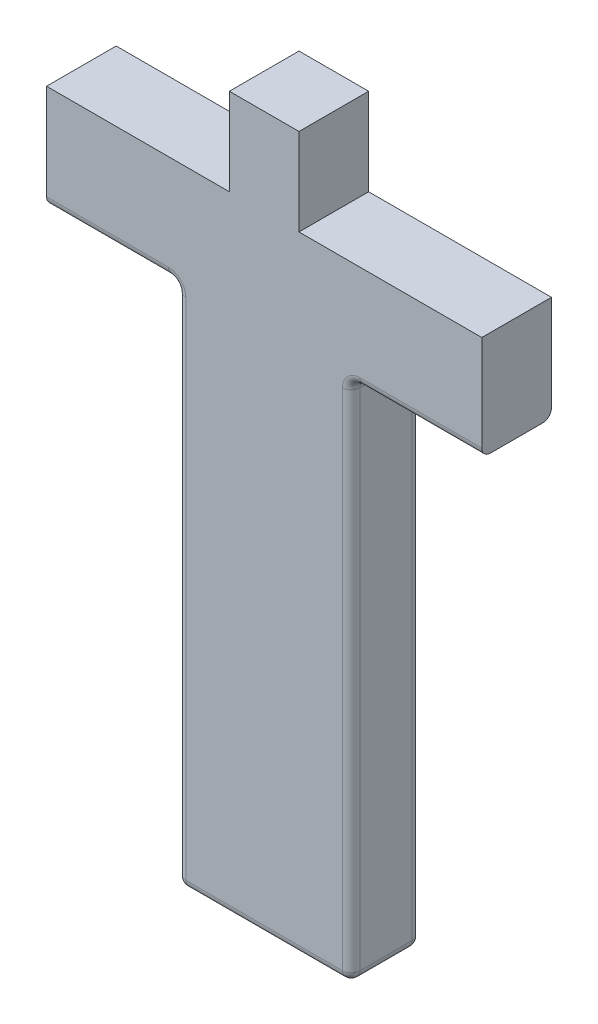
ISO-10303-21;
HEADER;
FILE_DESCRIPTION(('STEP AP214'),'2;1');
FILE_NAME('part.step','',(''),(''),'','','');
FILE_SCHEMA(('AUTOMOTIVE_DESIGN { 1 0 10303 214 1 1 1 1 }'));
ENDSEC;
DATA;
#1=APPLICATION_CONTEXT('core data for automotive mechanical design processes');
#2=APPLICATION_PROTOCOL_DEFINITION('international standard','automotive_design',2000,#1);
#3=PRODUCT_CONTEXT('',#1,'mechanical');
#4=PRODUCT('Part','Part','',(#3));
#5=PRODUCT_RELATED_PRODUCT_CATEGORY('part','',(#4));
#6=PRODUCT_DEFINITION_FORMATION('','',#4);
#7=PRODUCT_DEFINITION_CONTEXT('part definition',#1,'design');
#8=PRODUCT_DEFINITION('design','',#6,#7);
#9=PRODUCT_DEFINITION_SHAPE('','',#8);
#10=(LENGTH_UNIT() NAMED_UNIT(*) SI_UNIT(.MILLI.,.METRE.));
#11=(NAMED_UNIT(*) PLANE_ANGLE_UNIT() SI_UNIT($,.RADIAN.));
#12=(NAMED_UNIT(*) SI_UNIT($,.STERADIAN.) SOLID_ANGLE_UNIT());
#13=UNCERTAINTY_MEASURE_WITH_UNIT(LENGTH_MEASURE(1.E-05),#10,'distance_accuracy_value','');
#14=(GEOMETRIC_REPRESENTATION_CONTEXT(3) GLOBAL_UNCERTAINTY_ASSIGNED_CONTEXT((#13)) GLOBAL_UNIT_ASSIGNED_CONTEXT((#10,
#11,#12)) REPRESENTATION_CONTEXT('',''));
#15=CARTESIAN_POINT('',(0.,0.,0.));
#16=DIRECTION('',(0.,0.,1.));
#17=DIRECTION('',(1.,0.,0.));
#18=AXIS2_PLACEMENT_3D('',#15,#16,#17);
#19=CARTESIAN_POINT('',(0.,0.,8.));
#20=DIRECTION('',(0.,0.,1.));
#21=DIRECTION('',(1.,0.,0.));
#22=AXIS2_PLACEMENT_3D('',#19,#20,#21);
#23=PLANE('',#22);
#24=CARTESIAN_POINT('',(-11.,-7.,8.));
#25=DIRECTION('',(0.,0.,1.));
#26=DIRECTION('',(1.,0.,0.));
#27=AXIS2_PLACEMENT_3D('',#24,#25,#26);
#28=CIRCLE('',#27,2.);
#29=CARTESIAN_POINT('',(-8.99999999999999,-7.,8.));
#30=VERTEX_POINT('',#29);
#31=CARTESIAN_POINT('',(-11.,-5.,8.));
#32=VERTEX_POINT('',#31);
#33=EDGE_CURVE('E367',#30,#32,#28,.T.);
#34=ORIENTED_EDGE('',*,*,#33,.F.);
#35=DIRECTION('',(0.,-1.,0.));
#36=VECTOR('',#35,1.);
#37=CARTESIAN_POINT('',(-8.99999999999999,-66.,8.));
#38=LINE('',#37,#36);
#39=CARTESIAN_POINT('',(-8.99999999999999,-65.,8.));
#40=VERTEX_POINT('',#39);
#41=EDGE_CURVE('E363',#30,#40,#38,.T.);
#42=ORIENTED_EDGE('',*,*,#41,.T.);
#43=DIRECTION('',(1.,0.,0.));
#44=VECTOR('',#43,1.);
#45=CARTESIAN_POINT('',(9.00000000000001,-65.,8.));
#46=LINE('',#45,#44);
#47=CARTESIAN_POINT('',(9.00000000000001,-65.,8.));
#48=VERTEX_POINT('',#47);
#49=EDGE_CURVE('E365',#40,#48,#46,.T.);
#50=ORIENTED_EDGE('',*,*,#49,.T.);
#51=DIRECTION('',(0.,-1.,0.));
#52=VECTOR('',#51,1.);
#53=CARTESIAN_POINT('',(9.00000000000001,0.,8.));
#54=LINE('',#53,#52);
#55=CARTESIAN_POINT('',(9.00000000000001,-7.,8.));
#56=VERTEX_POINT('',#55);
#57=EDGE_CURVE('E303',#48,#56,#54,.F.);
#58=ORIENTED_EDGE('',*,*,#57,.T.);
#59=CARTESIAN_POINT('',(11.,-7.,8.));
#60=DIRECTION('',(0.,0.,1.));
#61=DIRECTION('',(1.,0.,0.));
#62=AXIS2_PLACEMENT_3D('',#59,#60,#61);
#63=CIRCLE('',#62,2.);
#64=CARTESIAN_POINT('',(11.,-5.,8.));
#65=VERTEX_POINT('',#64);
#66=EDGE_CURVE('E300',#65,#56,#63,.T.);
#67=ORIENTED_EDGE('',*,*,#66,.F.);
#68=DIRECTION('',(1.,0.,0.));
#69=VECTOR('',#68,1.);
#70=CARTESIAN_POINT('',(25.,-5.,8.));
#71=LINE('',#70,#69);
#72=CARTESIAN_POINT('',(25.,-5.,8.));
#73=VERTEX_POINT('',#72);
#74=EDGE_CURVE('E298',#65,#73,#71,.T.);
#75=ORIENTED_EDGE('',*,*,#74,.T.);
#76=DIRECTION('',(0.,-1.,0.));
#77=VECTOR('',#76,1.);
#78=CARTESIAN_POINT('',(25.,0.,8.));
#79=LINE('',#78,#77);
#80=CARTESIAN_POINT('',(25.,6.,8.));
#81=VERTEX_POINT('',#80);
#82=EDGE_CURVE('E225',#81,#73,#79,.T.);
#83=ORIENTED_EDGE('',*,*,#82,.F.);
#84=DIRECTION('',(1.,0.,0.));
#85=VECTOR('',#84,1.);
#86=CARTESIAN_POINT('',(0.,6.,8.));
#87=LINE('',#86,#85);
#88=CARTESIAN_POINT('',(4.00000000000001,6.,8.));
#89=VERTEX_POINT('',#88);
#90=EDGE_CURVE('E224',#89,#81,#87,.T.);
#91=ORIENTED_EDGE('',*,*,#90,.F.);
#92=DIRECTION('',(0.,1.,0.));
#93=VECTOR('',#92,1.);
#94=CARTESIAN_POINT('',(4.00000000000001,0.,8.));
#95=LINE('',#94,#93);
#96=CARTESIAN_POINT('',(4.00000000000001,16.,8.));
#97=VERTEX_POINT('',#96);
#98=EDGE_CURVE('E228',#89,#97,#95,.T.);
#99=ORIENTED_EDGE('',*,*,#98,.T.);
#100=DIRECTION('',(1.,0.,0.));
#101=VECTOR('',#100,1.);
#102=CARTESIAN_POINT('',(0.,16.,8.));
#103=LINE('',#102,#101);
#104=CARTESIAN_POINT('',(-3.99999999999999,16.,8.));
#105=VERTEX_POINT('',#104);
#106=EDGE_CURVE('E217',#105,#97,#103,.T.);
#107=ORIENTED_EDGE('',*,*,#106,.F.);
#108=DIRECTION('',(0.,1.,0.));
#109=VECTOR('',#108,1.);
#110=CARTESIAN_POINT('',(-3.99999999999999,0.,8.));
#111=LINE('',#110,#109);
#112=CARTESIAN_POINT('',(-3.99999999999999,6.,8.));
#113=VERTEX_POINT('',#112);
#114=EDGE_CURVE('E201',#113,#105,#111,.T.);
#115=ORIENTED_EDGE('',*,*,#114,.F.);
#116=CARTESIAN_POINT('',(-25.,6.,8.));
#117=VERTEX_POINT('',#116);
#118=EDGE_CURVE('E215',#117,#113,#87,.T.);
#119=ORIENTED_EDGE('',*,*,#118,.F.);
#120=DIRECTION('',(0.,-1.,0.));
#121=VECTOR('',#120,1.);
#122=CARTESIAN_POINT('',(-25.,0.,8.));
#123=LINE('',#122,#121);
#124=CARTESIAN_POINT('',(-25.,-5.,8.));
#125=VERTEX_POINT('',#124);
#126=EDGE_CURVE('E222',#117,#125,#123,.T.);
#127=ORIENTED_EDGE('',*,*,#126,.T.);
#128=DIRECTION('',(1.,0.,0.));
#129=VECTOR('',#128,1.);
#130=CARTESIAN_POINT('',(-9.99999999999999,-5.,8.));
#131=LINE('',#130,#129);
#132=EDGE_CURVE('E209',#125,#32,#131,.T.);
#133=ORIENTED_EDGE('',*,*,#132,.T.);
#134=EDGE_LOOP('',(#34,#42,#50,#58,#67,#75,#83,#91,#99,#107,#115,#119,#127,#133));
#135=FACE_BOUND('',#134,.T.);
#136=ADVANCED_FACE('F35',(#135),#23,.T.);
#137=CARTESIAN_POINT('',(-3.99999999999999,0.,8.));
#138=DIRECTION('',(-1.,0.,0.));
#139=DIRECTION('',(0.,0.,1.));
#140=AXIS2_PLACEMENT_3D('',#137,#138,#139);
#141=PLANE('',#140);
#142=DIRECTION('',(0.,1.,0.));
#143=VECTOR('',#142,1.);
#144=CARTESIAN_POINT('',(-3.99999999999999,0.,0.));
#145=LINE('',#144,#143);
#146=CARTESIAN_POINT('',(-3.99999999999999,6.,0.));
#147=VERTEX_POINT('',#146);
#148=CARTESIAN_POINT('',(-3.99999999999999,16.,0.));
#149=VERTEX_POINT('',#148);
#150=EDGE_CURVE('E204',#147,#149,#145,.T.);
#151=ORIENTED_EDGE('',*,*,#150,.F.);
#152=DIRECTION('',(0.,0.,-1.));
#153=VECTOR('',#152,1.);
#154=CARTESIAN_POINT('',(-3.99999999999999,6.,8.));
#155=LINE('',#154,#153);
#156=EDGE_CURVE('E198',#113,#147,#155,.T.);
#157=ORIENTED_EDGE('',*,*,#156,.F.);
#158=ORIENTED_EDGE('',*,*,#114,.T.);
#159=DIRECTION('',(0.,0.,-1.));
#160=VECTOR('',#159,1.);
#161=CARTESIAN_POINT('',(-3.99999999999999,16.,8.));
#162=LINE('',#161,#160);
#163=EDGE_CURVE('E239',#105,#149,#162,.T.);
#164=ORIENTED_EDGE('',*,*,#163,.T.);
#165=EDGE_LOOP('',(#151,#157,#158,#164));
#166=FACE_BOUND('',#165,.T.);
#167=ADVANCED_FACE('F200',(#166),#141,.T.);
#168=CARTESIAN_POINT('',(0.,6.,8.));
#169=DIRECTION('',(0.,1.,0.));
#170=DIRECTION('',(0.,0.,1.));
#171=AXIS2_PLACEMENT_3D('',#168,#169,#170);
#172=PLANE('',#171);
#173=DIRECTION('',(1.,0.,0.));
#174=VECTOR('',#173,1.);
#175=CARTESIAN_POINT('',(0.,6.,0.));
#176=LINE('',#175,#174);
#177=CARTESIAN_POINT('',(-25.,6.,0.));
#178=VERTEX_POINT('',#177);
#179=EDGE_CURVE('E241',#178,#147,#176,.T.);
#180=ORIENTED_EDGE('',*,*,#179,.F.);
#181=DIRECTION('',(0.,0.,-1.));
#182=VECTOR('',#181,1.);
#183=CARTESIAN_POINT('',(-25.,6.,8.));
#184=LINE('',#183,#182);
#185=EDGE_CURVE('E210',#117,#178,#184,.T.);
#186=ORIENTED_EDGE('',*,*,#185,.F.);
#187=ORIENTED_EDGE('',*,*,#118,.T.);
#188=ORIENTED_EDGE('',*,*,#156,.T.);
#189=EDGE_LOOP('',(#180,#186,#187,#188));
#190=FACE_BOUND('',#189,.T.);
#191=ADVANCED_FACE('F220',(#190),#172,.T.);
#192=CARTESIAN_POINT('',(-25.,0.,8.));
#193=DIRECTION('',(1.,0.,0.));
#194=DIRECTION('',(0.,0.,-1.));
#195=AXIS2_PLACEMENT_3D('',#192,#193,#194);
#196=PLANE('',#195);
#197=DIRECTION('',(0.,-1.,0.));
#198=VECTOR('',#197,1.);
#199=CARTESIAN_POINT('',(-25.,0.,0.));
#200=LINE('',#199,#198);
#201=CARTESIAN_POINT('',(-25.,-5.,0.));
#202=VERTEX_POINT('',#201);
#203=EDGE_CURVE('E244',#178,#202,#200,.T.);
#204=ORIENTED_EDGE('',*,*,#203,.T.);
#205=CARTESIAN_POINT('',(-25.,-5.,1.));
#206=DIRECTION('',(1.,0.,0.));
#207=DIRECTION('',(0.,0.,-1.));
#208=AXIS2_PLACEMENT_3D('',#205,#206,#207);
#209=CIRCLE('',#208,1.);
#210=CARTESIAN_POINT('',(-25.,-6.,1.));
#211=VERTEX_POINT('',#210);
#212=EDGE_CURVE('E326',#202,#211,#209,.F.);
#213=ORIENTED_EDGE('',*,*,#212,.T.);
#214=DIRECTION('',(0.,0.,-1.));
#215=VECTOR('',#214,1.);
#216=CARTESIAN_POINT('',(-25.,-6.,8.));
#217=LINE('',#216,#215);
#218=CARTESIAN_POINT('',(-25.,-6.,7.));
#219=VERTEX_POINT('',#218);
#220=EDGE_CURVE('E266',#219,#211,#217,.T.);
#221=ORIENTED_EDGE('',*,*,#220,.F.);
#222=CARTESIAN_POINT('',(-25.,-5.,7.));
#223=DIRECTION('',(1.,0.,0.));
#224=DIRECTION('',(0.,0.,-1.));
#225=AXIS2_PLACEMENT_3D('',#222,#223,#224);
#226=CIRCLE('',#225,1.);
#227=EDGE_CURVE('E274',#219,#125,#226,.F.);
#228=ORIENTED_EDGE('',*,*,#227,.T.);
#229=ORIENTED_EDGE('',*,*,#126,.F.);
#230=ORIENTED_EDGE('',*,*,#185,.T.);
#231=EDGE_LOOP('',(#204,#213,#221,#228,#229,#230));
#232=FACE_BOUND('',#231,.T.);
#233=ADVANCED_FACE('F475',(#232),#196,.F.);
#234=CARTESIAN_POINT('',(0.,-6.,8.));
#235=DIRECTION('',(0.,1.,0.));
#236=DIRECTION('',(0.,0.,1.));
#237=AXIS2_PLACEMENT_3D('',#234,#235,#236);
#238=PLANE('',#237);
#239=ORIENTED_EDGE('',*,*,#220,.T.);
#240=DIRECTION('',(1.,0.,0.));
#241=VECTOR('',#240,1.);
#242=CARTESIAN_POINT('',(0.,-6.,1.));
#243=LINE('',#242,#241);
#244=CARTESIAN_POINT('',(-11.,-6.,1.));
#245=VERTEX_POINT('',#244);
#246=EDGE_CURVE('E324',#211,#245,#243,.T.);
#247=ORIENTED_EDGE('',*,*,#246,.T.);
#248=DIRECTION('',(0.,0.,-1.));
#249=VECTOR('',#248,1.);
#250=CARTESIAN_POINT('',(-11.,-6.,7.));
#251=LINE('',#250,#249);
#252=CARTESIAN_POINT('',(-11.,-6.,7.));
#253=VERTEX_POINT('',#252);
#254=EDGE_CURVE('E321',#245,#253,#251,.F.);
#255=ORIENTED_EDGE('',*,*,#254,.T.);
#256=DIRECTION('',(1.,0.,0.));
#257=VECTOR('',#256,1.);
#258=CARTESIAN_POINT('',(-25.,-6.,7.));
#259=LINE('',#258,#257);
#260=EDGE_CURVE('E272',#253,#219,#259,.F.);
#261=ORIENTED_EDGE('',*,*,#260,.T.);
#262=EDGE_LOOP('',(#239,#247,#255,#261));
#263=FACE_BOUND('',#262,.T.);
#264=ADVANCED_FACE('F483',(#263),#238,.F.);
#265=CARTESIAN_POINT('',(-9.99999999999999,0.,8.));
#266=DIRECTION('',(1.,0.,0.));
#267=DIRECTION('',(0.,1.,0.));
#268=AXIS2_PLACEMENT_3D('',#265,#266,#267);
#269=PLANE('',#268);
#270=DIRECTION('',(0.,-1.,0.));
#271=VECTOR('',#270,1.);
#272=CARTESIAN_POINT('',(-9.99999999999999,0.,1.));
#273=LINE('',#272,#271);
#274=CARTESIAN_POINT('',(-9.99999999999999,-7.,1.));
#275=VERTEX_POINT('',#274);
#276=CARTESIAN_POINT('',(-9.99999999999999,-65.,1.));
#277=VERTEX_POINT('',#276);
#278=EDGE_CURVE('E307',#275,#277,#273,.T.);
#279=ORIENTED_EDGE('',*,*,#278,.T.);
#280=DIRECTION('',(0.,0.,-1.));
#281=VECTOR('',#280,1.);
#282=CARTESIAN_POINT('',(-9.99999999999999,-65.,8.));
#283=LINE('',#282,#281);
#284=CARTESIAN_POINT('',(-9.99999999999999,-65.,7.));
#285=VERTEX_POINT('',#284);
#286=EDGE_CURVE('E11',#277,#285,#283,.F.);
#287=ORIENTED_EDGE('',*,*,#286,.T.);
#288=DIRECTION('',(0.,-1.,0.));
#289=VECTOR('',#288,1.);
#290=CARTESIAN_POINT('',(-9.99999999999999,-6.73205080756888,7.));
#291=LINE('',#290,#289);
#292=CARTESIAN_POINT('',(-9.99999999999999,-7.,7.));
#293=VERTEX_POINT('',#292);
#294=EDGE_CURVE('E44',#285,#293,#291,.F.);
#295=ORIENTED_EDGE('',*,*,#294,.T.);
#296=DIRECTION('',(0.,0.,-1.));
#297=VECTOR('',#296,1.);
#298=CARTESIAN_POINT('',(-9.99999999999999,-7.,0.));
#299=LINE('',#298,#297);
#300=EDGE_CURVE('E305',#293,#275,#299,.T.);
#301=ORIENTED_EDGE('',*,*,#300,.T.);
#302=EDGE_LOOP('',(#279,#287,#295,#301));
#303=FACE_BOUND('',#302,.T.);
#304=ADVANCED_FACE('F552',(#303),#269,.F.);
#305=CARTESIAN_POINT('',(0.,-66.,8.));
#306=DIRECTION('',(0.,1.,0.));
#307=DIRECTION('',(0.,0.,1.));
#308=AXIS2_PLACEMENT_3D('',#305,#306,#307);
#309=PLANE('',#308);
#310=DIRECTION('',(1.,0.,0.));
#311=VECTOR('',#310,1.);
#312=CARTESIAN_POINT('',(0.,-66.,1.));
#313=LINE('',#312,#311);
#314=CARTESIAN_POINT('',(-8.99999999999999,-66.,1.));
#315=VERTEX_POINT('',#314);
#316=CARTESIAN_POINT('',(9.00000000000001,-66.,1.));
#317=VERTEX_POINT('',#316);
#318=EDGE_CURVE('E58',#315,#317,#313,.T.);
#319=ORIENTED_EDGE('',*,*,#318,.T.);
#320=DIRECTION('',(0.,0.,-1.));
#321=VECTOR('',#320,1.);
#322=CARTESIAN_POINT('',(9.00000000000001,-66.,7.));
#323=LINE('',#322,#321);
#324=CARTESIAN_POINT('',(9.00000000000001,-66.,7.));
#325=VERTEX_POINT('',#324);
#326=EDGE_CURVE('E377',#317,#325,#323,.F.);
#327=ORIENTED_EDGE('',*,*,#326,.T.);
#328=DIRECTION('',(1.,0.,0.));
#329=VECTOR('',#328,1.);
#330=CARTESIAN_POINT('',(-9.99999999999999,-66.,7.));
#331=LINE('',#330,#329);
#332=CARTESIAN_POINT('',(-8.99999999999999,-66.,7.));
#333=VERTEX_POINT('',#332);
#334=EDGE_CURVE('E372',#325,#333,#331,.F.);
#335=ORIENTED_EDGE('',*,*,#334,.T.);
#336=DIRECTION('',(0.,0.,-1.));
#337=VECTOR('',#336,1.);
#338=CARTESIAN_POINT('',(-8.99999999999999,-66.,8.));
#339=LINE('',#338,#337);
#340=EDGE_CURVE('E374',#333,#315,#339,.T.);
#341=ORIENTED_EDGE('',*,*,#340,.T.);
#342=EDGE_LOOP('',(#319,#327,#335,#341));
#343=FACE_BOUND('',#342,.T.);
#344=ADVANCED_FACE('F512',(#343),#309,.F.);
#345=CARTESIAN_POINT('',(10.,0.,8.));
#346=DIRECTION('',(1.,0.,0.));
#347=DIRECTION('',(0.,1.,0.));
#348=AXIS2_PLACEMENT_3D('',#345,#346,#347);
#349=PLANE('',#348);
#350=DIRECTION('',(0.,-1.,0.));
#351=VECTOR('',#350,1.);
#352=CARTESIAN_POINT('',(10.,0.,7.));
#353=LINE('',#352,#351);
#354=CARTESIAN_POINT('',(10.,-7.,7.));
#355=VERTEX_POINT('',#354);
#356=CARTESIAN_POINT('',(10.,-65.,7.));
#357=VERTEX_POINT('',#356);
#358=EDGE_CURVE('E293',#355,#357,#353,.T.);
#359=ORIENTED_EDGE('',*,*,#358,.T.);
#360=DIRECTION('',(0.,0.,-1.));
#361=VECTOR('',#360,1.);
#362=CARTESIAN_POINT('',(10.,-65.,1.));
#363=LINE('',#362,#361);
#364=CARTESIAN_POINT('',(10.,-65.,1.));
#365=VERTEX_POINT('',#364);
#366=EDGE_CURVE('E370',#357,#365,#363,.T.);
#367=ORIENTED_EDGE('',*,*,#366,.T.);
#368=DIRECTION('',(0.,-1.,0.));
#369=VECTOR('',#368,1.);
#370=CARTESIAN_POINT('',(10.,-6.,1.));
#371=LINE('',#370,#369);
#372=CARTESIAN_POINT('',(10.,-7.,1.));
#373=VERTEX_POINT('',#372);
#374=EDGE_CURVE('E296',#365,#373,#371,.F.);
#375=ORIENTED_EDGE('',*,*,#374,.T.);
#376=DIRECTION('',(0.,0.,-1.));
#377=VECTOR('',#376,1.);
#378=CARTESIAN_POINT('',(10.,-7.,8.));
#379=LINE('',#378,#377);
#380=EDGE_CURVE('E291',#373,#355,#379,.F.);
#381=ORIENTED_EDGE('',*,*,#380,.T.);
#382=EDGE_LOOP('',(#359,#367,#375,#381));
#383=FACE_BOUND('',#382,.T.);
#384=ADVANCED_FACE('F438',(#383),#349,.T.);
#385=DIRECTION('',(0.,0.,-1.));
#386=VECTOR('',#385,1.);
#387=CARTESIAN_POINT('',(11.,-6.,8.));
#388=LINE('',#387,#386);
#389=CARTESIAN_POINT('',(11.,-6.,7.));
#390=VERTEX_POINT('',#389);
#391=CARTESIAN_POINT('',(11.,-6.,1.));
#392=VERTEX_POINT('',#391);
#393=EDGE_CURVE('E311',#390,#392,#388,.T.);
#394=ORIENTED_EDGE('',*,*,#393,.T.);
#395=DIRECTION('',(1.,0.,0.));
#396=VECTOR('',#395,1.);
#397=CARTESIAN_POINT('',(0.,-6.,1.));
#398=LINE('',#397,#396);
#399=CARTESIAN_POINT('',(25.,-6.,1.));
#400=VERTEX_POINT('',#399);
#401=EDGE_CURVE('E315',#392,#400,#398,.T.);
#402=ORIENTED_EDGE('',*,*,#401,.T.);
#403=DIRECTION('',(0.,0.,-1.));
#404=VECTOR('',#403,1.);
#405=CARTESIAN_POINT('',(25.,-6.,8.));
#406=LINE('',#405,#404);
#407=CARTESIAN_POINT('',(25.,-6.,7.));
#408=VERTEX_POINT('',#407);
#409=EDGE_CURVE('E263',#408,#400,#406,.T.);
#410=ORIENTED_EDGE('',*,*,#409,.F.);
#411=DIRECTION('',(1.,0.,0.));
#412=VECTOR('',#411,1.);
#413=CARTESIAN_POINT('',(10.,-6.,7.));
#414=LINE('',#413,#412);
#415=EDGE_CURVE('E313',#408,#390,#414,.F.);
#416=ORIENTED_EDGE('',*,*,#415,.T.);
#417=EDGE_LOOP('',(#394,#402,#410,#416));
#418=FACE_BOUND('',#417,.T.);
#419=ADVANCED_FACE('F455',(#418),#238,.F.);
#420=CARTESIAN_POINT('',(25.,0.,8.));
#421=DIRECTION('',(1.,0.,0.));
#422=DIRECTION('',(0.,0.,-1.));
#423=AXIS2_PLACEMENT_3D('',#420,#421,#422);
#424=PLANE('',#423);
#425=ORIENTED_EDGE('',*,*,#409,.T.);
#426=CARTESIAN_POINT('',(25.,-5.,1.));
#427=DIRECTION('',(1.,0.,0.));
#428=DIRECTION('',(0.,0.,-1.));
#429=AXIS2_PLACEMENT_3D('',#426,#427,#428);
#430=CIRCLE('',#429,1.);
#431=CARTESIAN_POINT('',(25.,-5.,0.));
#432=VERTEX_POINT('',#431);
#433=EDGE_CURVE('E319',#400,#432,#430,.T.);
#434=ORIENTED_EDGE('',*,*,#433,.T.);
#435=DIRECTION('',(0.,-1.,0.));
#436=VECTOR('',#435,1.);
#437=CARTESIAN_POINT('',(25.,0.,0.));
#438=LINE('',#437,#436);
#439=CARTESIAN_POINT('',(25.,6.,0.));
#440=VERTEX_POINT('',#439);
#441=EDGE_CURVE('E248',#440,#432,#438,.T.);
#442=ORIENTED_EDGE('',*,*,#441,.F.);
#443=DIRECTION('',(0.,0.,-1.));
#444=VECTOR('',#443,1.);
#445=CARTESIAN_POINT('',(25.,6.,8.));
#446=LINE('',#445,#444);
#447=EDGE_CURVE('E261',#81,#440,#446,.T.);
#448=ORIENTED_EDGE('',*,*,#447,.F.);
#449=ORIENTED_EDGE('',*,*,#82,.T.);
#450=CARTESIAN_POINT('',(25.,-5.,7.));
#451=DIRECTION('',(1.,0.,0.));
#452=DIRECTION('',(0.,0.,-1.));
#453=AXIS2_PLACEMENT_3D('',#450,#451,#452);
#454=CIRCLE('',#453,1.);
#455=EDGE_CURVE('E317',#73,#408,#454,.T.);
#456=ORIENTED_EDGE('',*,*,#455,.T.);
#457=EDGE_LOOP('',(#425,#434,#442,#448,#449,#456));
#458=FACE_BOUND('',#457,.T.);
#459=ADVANCED_FACE('F452',(#458),#424,.T.);
#460=CARTESIAN_POINT('',(4.00000000000001,6.,0.));
#461=VERTEX_POINT('',#460);
#462=EDGE_CURVE('E245',#461,#440,#176,.T.);
#463=ORIENTED_EDGE('',*,*,#462,.F.);
#464=DIRECTION('',(0.,0.,-1.));
#465=VECTOR('',#464,1.);
#466=CARTESIAN_POINT('',(4.00000000000001,6.,8.));
#467=LINE('',#466,#465);
#468=EDGE_CURVE('E259',#89,#461,#467,.T.);
#469=ORIENTED_EDGE('',*,*,#468,.F.);
#470=ORIENTED_EDGE('',*,*,#90,.T.);
#471=ORIENTED_EDGE('',*,*,#447,.T.);
#472=EDGE_LOOP('',(#463,#469,#470,#471));
#473=FACE_BOUND('',#472,.T.);
#474=ADVANCED_FACE('F463',(#473),#172,.T.);
#475=CARTESIAN_POINT('',(4.00000000000001,0.,8.));
#476=DIRECTION('',(-1.,0.,0.));
#477=DIRECTION('',(0.,0.,1.));
#478=AXIS2_PLACEMENT_3D('',#475,#476,#477);
#479=PLANE('',#478);
#480=DIRECTION('',(0.,1.,0.));
#481=VECTOR('',#480,1.);
#482=CARTESIAN_POINT('',(4.00000000000001,0.,0.));
#483=LINE('',#482,#481);
#484=CARTESIAN_POINT('',(4.00000000000001,16.,0.));
#485=VERTEX_POINT('',#484);
#486=EDGE_CURVE('E251',#461,#485,#483,.T.);
#487=ORIENTED_EDGE('',*,*,#486,.T.);
#488=DIRECTION('',(0.,0.,-1.));
#489=VECTOR('',#488,1.);
#490=CARTESIAN_POINT('',(4.00000000000001,16.,8.));
#491=LINE('',#490,#489);
#492=EDGE_CURVE('E257',#97,#485,#491,.T.);
#493=ORIENTED_EDGE('',*,*,#492,.F.);
#494=ORIENTED_EDGE('',*,*,#98,.F.);
#495=ORIENTED_EDGE('',*,*,#468,.T.);
#496=EDGE_LOOP('',(#487,#493,#494,#495));
#497=FACE_BOUND('',#496,.T.);
#498=ADVANCED_FACE('F467',(#497),#479,.F.);
#499=CARTESIAN_POINT('',(0.,16.,8.));
#500=DIRECTION('',(0.,1.,0.));
#501=DIRECTION('',(0.,0.,1.));
#502=AXIS2_PLACEMENT_3D('',#499,#500,#501);
#503=PLANE('',#502);
#504=DIRECTION('',(1.,0.,0.));
#505=VECTOR('',#504,1.);
#506=CARTESIAN_POINT('',(0.,16.,0.));
#507=LINE('',#506,#505);
#508=EDGE_CURVE('E218',#149,#485,#507,.T.);
#509=ORIENTED_EDGE('',*,*,#508,.F.);
#510=ORIENTED_EDGE('',*,*,#163,.F.);
#511=ORIENTED_EDGE('',*,*,#106,.T.);
#512=ORIENTED_EDGE('',*,*,#492,.T.);
#513=EDGE_LOOP('',(#509,#510,#511,#512));
#514=FACE_BOUND('',#513,.T.);
#515=ADVANCED_FACE('F470',(#514),#503,.T.);
#516=CARTESIAN_POINT('',(0.,0.,0.));
#517=DIRECTION('',(0.,0.,1.));
#518=DIRECTION('',(1.,0.,0.));
#519=AXIS2_PLACEMENT_3D('',#516,#517,#518);
#520=PLANE('',#519);
#521=DIRECTION('',(0.,-1.,0.));
#522=VECTOR('',#521,1.);
#523=CARTESIAN_POINT('',(9.00000000000001,-66.,0.));
#524=LINE('',#523,#522);
#525=CARTESIAN_POINT('',(9.00000000000001,-7.,0.));
#526=VERTEX_POINT('',#525);
#527=CARTESIAN_POINT('',(9.00000000000001,-65.,0.));
#528=VERTEX_POINT('',#527);
#529=EDGE_CURVE('E288',#526,#528,#524,.T.);
#530=ORIENTED_EDGE('',*,*,#529,.T.);
#531=DIRECTION('',(1.,0.,0.));
#532=VECTOR('',#531,1.);
#533=CARTESIAN_POINT('',(0.,-65.,0.));
#534=LINE('',#533,#532);
#535=CARTESIAN_POINT('',(-8.99999999999999,-65.,0.));
#536=VERTEX_POINT('',#535);
#537=EDGE_CURVE('E379',#528,#536,#534,.F.);
#538=ORIENTED_EDGE('',*,*,#537,.T.);
#539=DIRECTION('',(0.,-1.,0.));
#540=VECTOR('',#539,1.);
#541=CARTESIAN_POINT('',(-8.99999999999999,0.,0.));
#542=LINE('',#541,#540);
#543=CARTESIAN_POINT('',(-8.99999999999999,-7.,0.));
#544=VERTEX_POINT('',#543);
#545=EDGE_CURVE('E281',#536,#544,#542,.F.);
#546=ORIENTED_EDGE('',*,*,#545,.T.);
#547=CARTESIAN_POINT('',(-11.,-7.,0.));
#548=DIRECTION('',(0.,0.,1.));
#549=DIRECTION('',(1.,0.,0.));
#550=AXIS2_PLACEMENT_3D('',#547,#548,#549);
#551=CIRCLE('',#550,2.);
#552=CARTESIAN_POINT('',(-11.,-5.,0.));
#553=VERTEX_POINT('',#552);
#554=EDGE_CURVE('E278',#553,#544,#551,.F.);
#555=ORIENTED_EDGE('',*,*,#554,.F.);
#556=DIRECTION('',(1.,0.,0.));
#557=VECTOR('',#556,1.);
#558=CARTESIAN_POINT('',(0.,-5.,0.));
#559=LINE('',#558,#557);
#560=EDGE_CURVE('E276',#553,#202,#559,.F.);
#561=ORIENTED_EDGE('',*,*,#560,.T.);
#562=ORIENTED_EDGE('',*,*,#203,.F.);
#563=ORIENTED_EDGE('',*,*,#179,.T.);
#564=ORIENTED_EDGE('',*,*,#150,.T.);
#565=ORIENTED_EDGE('',*,*,#508,.T.);
#566=ORIENTED_EDGE('',*,*,#486,.F.);
#567=ORIENTED_EDGE('',*,*,#462,.T.);
#568=ORIENTED_EDGE('',*,*,#441,.T.);
#569=DIRECTION('',(1.,0.,0.));
#570=VECTOR('',#569,1.);
#571=CARTESIAN_POINT('',(0.,-5.,0.));
#572=LINE('',#571,#570);
#573=CARTESIAN_POINT('',(11.,-5.,0.));
#574=VERTEX_POINT('',#573);
#575=EDGE_CURVE('E286',#432,#574,#572,.F.);
#576=ORIENTED_EDGE('',*,*,#575,.T.);
#577=CARTESIAN_POINT('',(11.,-7.,0.));
#578=DIRECTION('',(0.,0.,1.));
#579=DIRECTION('',(1.,0.,0.));
#580=AXIS2_PLACEMENT_3D('',#577,#578,#579);
#581=CIRCLE('',#580,2.);
#582=EDGE_CURVE('E283',#526,#574,#581,.F.);
#583=ORIENTED_EDGE('',*,*,#582,.F.);
#584=EDGE_LOOP('',(#530,#538,#546,#555,#561,#562,#563,#564,#565,#566,#567,#568,#576,#583));
#585=FACE_BOUND('',#584,.T.);
#586=ADVANCED_FACE('F423',(#585),#520,.F.);
#587=CARTESIAN_POINT('',(0.,-5.,7.));
#588=DIRECTION('',(-1.,0.,0.));
#589=DIRECTION('',(0.,0.,1.));
#590=AXIS2_PLACEMENT_3D('',#587,#588,#589);
#591=CYLINDRICAL_SURFACE('',#590,1.);
#592=ORIENTED_EDGE('',*,*,#260,.F.);
#593=CARTESIAN_POINT('',(-11.,-5.,7.));
#594=DIRECTION('',(1.,0.,0.));
#595=DIRECTION('',(0.,1.,0.));
#596=AXIS2_PLACEMENT_3D('',#593,#594,#595);
#597=CIRCLE('',#596,1.);
#598=EDGE_CURVE('E309',#253,#32,#597,.F.);
#599=ORIENTED_EDGE('',*,*,#598,.T.);
#600=ORIENTED_EDGE('',*,*,#132,.F.);
#601=ORIENTED_EDGE('',*,*,#227,.F.);
#602=EDGE_LOOP('',(#592,#599,#600,#601));
#603=FACE_BOUND('',#602,.T.);
#604=ADVANCED_FACE('F496',(#603),#591,.T.);
#605=CARTESIAN_POINT('',(9.00000000000001,0.,7.));
#606=DIRECTION('',(0.,-1.,0.));
#607=DIRECTION('',(1.,0.,0.));
#608=AXIS2_PLACEMENT_3D('',#605,#606,#607);
#609=CYLINDRICAL_SURFACE('',#608,1.);
#610=ORIENTED_EDGE('',*,*,#57,.F.);
#611=CARTESIAN_POINT('',(9.00000000000001,-65.,7.));
#612=DIRECTION('',(0.,-1.,0.));
#613=DIRECTION('',(1.,0.,0.));
#614=AXIS2_PLACEMENT_3D('',#611,#612,#613);
#615=CIRCLE('',#614,1.);
#616=EDGE_CURVE('E361',#48,#357,#615,.F.);
#617=ORIENTED_EDGE('',*,*,#616,.T.);
#618=ORIENTED_EDGE('',*,*,#358,.F.);
#619=CARTESIAN_POINT('',(9.00000000000001,-7.,7.));
#620=DIRECTION('',(0.,1.,0.));
#621=DIRECTION('',(0.,0.,1.));
#622=AXIS2_PLACEMENT_3D('',#619,#620,#621);
#623=CIRCLE('',#622,1.);
#624=EDGE_CURVE('E242',#56,#355,#623,.T.);
#625=ORIENTED_EDGE('',*,*,#624,.F.);
#626=EDGE_LOOP('',(#610,#617,#618,#625));
#627=FACE_BOUND('',#626,.T.);
#628=ADVANCED_FACE('F442',(#627),#609,.T.);
#629=CARTESIAN_POINT('',(0.,-5.,7.));
#630=DIRECTION('',(-1.,0.,0.));
#631=DIRECTION('',(0.,0.,1.));
#632=AXIS2_PLACEMENT_3D('',#629,#630,#631);
#633=CYLINDRICAL_SURFACE('',#632,1.);
#634=ORIENTED_EDGE('',*,*,#455,.F.);
#635=ORIENTED_EDGE('',*,*,#74,.F.);
#636=CARTESIAN_POINT('',(11.,-5.,7.));
#637=DIRECTION('',(-1.,0.,0.));
#638=DIRECTION('',(0.,0.,1.));
#639=AXIS2_PLACEMENT_3D('',#636,#637,#638);
#640=CIRCLE('',#639,1.);
#641=EDGE_CURVE('E342',#390,#65,#640,.T.);
#642=ORIENTED_EDGE('',*,*,#641,.F.);
#643=ORIENTED_EDGE('',*,*,#415,.F.);
#644=EDGE_LOOP('',(#634,#635,#642,#643));
#645=FACE_BOUND('',#644,.T.);
#646=ADVANCED_FACE('F449',(#645),#633,.T.);
#647=CARTESIAN_POINT('',(11.,-7.,7.));
#648=DIRECTION('',(0.,0.,1.));
#649=DIRECTION('',(1.,0.,0.));
#650=AXIS2_PLACEMENT_3D('',#647,#648,#649);
#651=TOROIDAL_SURFACE('',#650,2.,1.);
#652=ORIENTED_EDGE('',*,*,#66,.T.);
#653=ORIENTED_EDGE('',*,*,#624,.T.);
#654=CARTESIAN_POINT('',(11.,-7.,7.));
#655=DIRECTION('',(0.,0.,1.));
#656=DIRECTION('',(1.,0.,0.));
#657=AXIS2_PLACEMENT_3D('',#654,#655,#656);
#658=CIRCLE('',#657,1.);
#659=EDGE_CURVE('E339',#390,#355,#658,.T.);
#660=ORIENTED_EDGE('',*,*,#659,.F.);
#661=ORIENTED_EDGE('',*,*,#641,.T.);
#662=EDGE_LOOP('',(#652,#653,#660,#661));
#663=FACE_BOUND('',#662,.T.);
#664=ADVANCED_FACE('F445',(#663),#651,.T.);
#665=CARTESIAN_POINT('',(11.,-7.,8.));
#666=DIRECTION('',(0.,0.,-1.));
#667=DIRECTION('',(-1.,0.,0.));
#668=AXIS2_PLACEMENT_3D('',#665,#666,#667);
#669=CYLINDRICAL_SURFACE('',#668,1.);
#670=ORIENTED_EDGE('',*,*,#659,.T.);
#671=ORIENTED_EDGE('',*,*,#380,.F.);
#672=CARTESIAN_POINT('',(11.,-7.,1.));
#673=DIRECTION('',(0.,0.,1.));
#674=DIRECTION('',(1.,0.,0.));
#675=AXIS2_PLACEMENT_3D('',#672,#673,#674);
#676=CIRCLE('',#675,1.);
#677=EDGE_CURVE('E336',#392,#373,#676,.T.);
#678=ORIENTED_EDGE('',*,*,#677,.F.);
#679=ORIENTED_EDGE('',*,*,#393,.F.);
#680=EDGE_LOOP('',(#670,#671,#678,#679));
#681=FACE_BOUND('',#680,.T.);
#682=ADVANCED_FACE('F434',(#681),#669,.F.);
#683=CARTESIAN_POINT('',(0.,-5.,1.));
#684=DIRECTION('',(1.,0.,0.));
#685=DIRECTION('',(0.,0.,-1.));
#686=AXIS2_PLACEMENT_3D('',#683,#684,#685);
#687=CYLINDRICAL_SURFACE('',#686,1.);
#688=ORIENTED_EDGE('',*,*,#433,.F.);
#689=ORIENTED_EDGE('',*,*,#401,.F.);
#690=CARTESIAN_POINT('',(11.,-5.,1.));
#691=DIRECTION('',(-1.,0.,0.));
#692=DIRECTION('',(0.,0.,1.));
#693=AXIS2_PLACEMENT_3D('',#690,#691,#692);
#694=CIRCLE('',#693,1.);
#695=EDGE_CURVE('E332',#574,#392,#694,.T.);
#696=ORIENTED_EDGE('',*,*,#695,.F.);
#697=ORIENTED_EDGE('',*,*,#575,.F.);
#698=EDGE_LOOP('',(#688,#689,#696,#697));
#699=FACE_BOUND('',#698,.T.);
#700=ADVANCED_FACE('F458',(#699),#687,.T.);
#701=CARTESIAN_POINT('',(11.,-7.,1.));
#702=DIRECTION('',(0.,0.,1.));
#703=DIRECTION('',(1.,0.,0.));
#704=AXIS2_PLACEMENT_3D('',#701,#702,#703);
#705=TOROIDAL_SURFACE('',#704,2.,1.);
#706=ORIENTED_EDGE('',*,*,#695,.T.);
#707=ORIENTED_EDGE('',*,*,#677,.T.);
#708=CARTESIAN_POINT('',(9.00000000000001,-7.,1.));
#709=DIRECTION('',(0.,1.,0.));
#710=DIRECTION('',(0.,0.,1.));
#711=AXIS2_PLACEMENT_3D('',#708,#709,#710);
#712=CIRCLE('',#711,1.);
#713=EDGE_CURVE('E329',#526,#373,#712,.F.);
#714=ORIENTED_EDGE('',*,*,#713,.F.);
#715=ORIENTED_EDGE('',*,*,#582,.T.);
#716=EDGE_LOOP('',(#706,#707,#714,#715));
#717=FACE_BOUND('',#716,.T.);
#718=ADVANCED_FACE('F429',(#717),#705,.T.);
#719=CARTESIAN_POINT('',(9.00000000000001,0.,1.));
#720=DIRECTION('',(0.,1.,0.));
#721=DIRECTION('',(-1.,0.,0.));
#722=AXIS2_PLACEMENT_3D('',#719,#720,#721);
#723=CYLINDRICAL_SURFACE('',#722,1.);
#724=ORIENTED_EDGE('',*,*,#374,.F.);
#725=CARTESIAN_POINT('',(9.00000000000001,-65.,1.));
#726=DIRECTION('',(0.,1.,0.));
#727=DIRECTION('',(-1.,0.,0.));
#728=AXIS2_PLACEMENT_3D('',#725,#726,#727);
#729=CIRCLE('',#728,1.);
#730=EDGE_CURVE('E359',#365,#528,#729,.T.);
#731=ORIENTED_EDGE('',*,*,#730,.T.);
#732=ORIENTED_EDGE('',*,*,#529,.F.);
#733=ORIENTED_EDGE('',*,*,#713,.T.);
#734=EDGE_LOOP('',(#724,#731,#732,#733));
#735=FACE_BOUND('',#734,.T.);
#736=ADVANCED_FACE('F421',(#735),#723,.T.);
#737=CARTESIAN_POINT('',(0.,-5.,1.));
#738=DIRECTION('',(1.,0.,0.));
#739=DIRECTION('',(0.,0.,-1.));
#740=AXIS2_PLACEMENT_3D('',#737,#738,#739);
#741=CYLINDRICAL_SURFACE('',#740,1.);
#742=ORIENTED_EDGE('',*,*,#212,.F.);
#743=ORIENTED_EDGE('',*,*,#560,.F.);
#744=CARTESIAN_POINT('',(-11.,-5.,1.));
#745=DIRECTION('',(1.,0.,0.));
#746=DIRECTION('',(0.,0.,-1.));
#747=AXIS2_PLACEMENT_3D('',#744,#745,#746);
#748=CIRCLE('',#747,1.);
#749=EDGE_CURVE('E353',#245,#553,#748,.T.);
#750=ORIENTED_EDGE('',*,*,#749,.F.);
#751=ORIENTED_EDGE('',*,*,#246,.F.);
#752=EDGE_LOOP('',(#742,#743,#750,#751));
#753=FACE_BOUND('',#752,.T.);
#754=ADVANCED_FACE('F479',(#753),#741,.T.);
#755=CARTESIAN_POINT('',(-11.,-7.,8.));
#756=DIRECTION('',(0.,0.,1.));
#757=DIRECTION('',(1.,0.,0.));
#758=AXIS2_PLACEMENT_3D('',#755,#756,#757);
#759=CYLINDRICAL_SURFACE('',#758,1.);
#760=CARTESIAN_POINT('',(-11.,-7.,7.));
#761=DIRECTION('',(0.,0.,1.));
#762=DIRECTION('',(1.,0.,0.));
#763=AXIS2_PLACEMENT_3D('',#760,#761,#762);
#764=CIRCLE('',#763,1.);
#765=EDGE_CURVE('E333',#293,#253,#764,.T.);
#766=ORIENTED_EDGE('',*,*,#765,.T.);
#767=ORIENTED_EDGE('',*,*,#254,.F.);
#768=CARTESIAN_POINT('',(-11.,-7.,1.));
#769=DIRECTION('',(0.,0.,1.));
#770=DIRECTION('',(1.,0.,0.));
#771=AXIS2_PLACEMENT_3D('',#768,#769,#770);
#772=CIRCLE('',#771,1.);
#773=EDGE_CURVE('E350',#275,#245,#772,.T.);
#774=ORIENTED_EDGE('',*,*,#773,.F.);
#775=ORIENTED_EDGE('',*,*,#300,.F.);
#776=EDGE_LOOP('',(#766,#767,#774,#775));
#777=FACE_BOUND('',#776,.T.);
#778=ADVANCED_FACE('F487',(#777),#759,.F.);
#779=CARTESIAN_POINT('',(-11.,-7.,1.));
#780=DIRECTION('',(0.,0.,1.));
#781=DIRECTION('',(1.,0.,0.));
#782=AXIS2_PLACEMENT_3D('',#779,#780,#781);
#783=TOROIDAL_SURFACE('',#782,2.,1.);
#784=ORIENTED_EDGE('',*,*,#749,.T.);
#785=ORIENTED_EDGE('',*,*,#554,.T.);
#786=CARTESIAN_POINT('',(-8.99999999999999,-7.,1.));
#787=DIRECTION('',(0.,1.,0.));
#788=DIRECTION('',(0.,0.,1.));
#789=AXIS2_PLACEMENT_3D('',#786,#787,#788);
#790=CIRCLE('',#789,1.);
#791=EDGE_CURVE('E347',#275,#544,#790,.F.);
#792=ORIENTED_EDGE('',*,*,#791,.F.);
#793=ORIENTED_EDGE('',*,*,#773,.T.);
#794=EDGE_LOOP('',(#784,#785,#792,#793));
#795=FACE_BOUND('',#794,.T.);
#796=ADVANCED_FACE('F576',(#795),#783,.T.);
#797=CARTESIAN_POINT('',(-8.99999999999999,0.,1.));
#798=DIRECTION('',(0.,-1.,0.));
#799=DIRECTION('',(1.,0.,0.));
#800=AXIS2_PLACEMENT_3D('',#797,#798,#799);
#801=CYLINDRICAL_SURFACE('',#800,1.);
#802=ORIENTED_EDGE('',*,*,#545,.F.);
#803=CARTESIAN_POINT('',(-8.99999999999999,-65.,1.));
#804=DIRECTION('',(0.,-1.,0.));
#805=DIRECTION('',(1.,0.,0.));
#806=AXIS2_PLACEMENT_3D('',#803,#804,#805);
#807=CIRCLE('',#806,1.);
#808=EDGE_CURVE('E328',#536,#277,#807,.F.);
#809=ORIENTED_EDGE('',*,*,#808,.T.);
#810=ORIENTED_EDGE('',*,*,#278,.F.);
#811=ORIENTED_EDGE('',*,*,#791,.T.);
#812=EDGE_LOOP('',(#802,#809,#810,#811));
#813=FACE_BOUND('',#812,.T.);
#814=ADVANCED_FACE('F573',(#813),#801,.T.);
#815=CARTESIAN_POINT('',(9.00000000000001,-65.,1.));
#816=DIRECTION('',(0.,1.,0.));
#817=DIRECTION('',(0.,0.,1.));
#818=AXIS2_PLACEMENT_3D('',#815,#816,#817);
#819=SPHERICAL_SURFACE('',#818,1.);
#820=CARTESIAN_POINT('',(9.00000000000001,-65.,1.));
#821=DIRECTION('',(-1.,0.,0.));
#822=DIRECTION('',(0.,0.,1.));
#823=AXIS2_PLACEMENT_3D('',#820,#821,#822);
#824=CIRCLE('',#823,1.);
#825=EDGE_CURVE('E405',#528,#317,#824,.T.);
#826=ORIENTED_EDGE('',*,*,#825,.F.);
#827=ORIENTED_EDGE('',*,*,#730,.F.);
#828=CARTESIAN_POINT('',(9.00000000000001,-65.,1.));
#829=DIRECTION('',(0.,0.,1.));
#830=DIRECTION('',(1.,0.,0.));
#831=AXIS2_PLACEMENT_3D('',#828,#829,#830);
#832=CIRCLE('',#831,1.);
#833=EDGE_CURVE('E39',#317,#365,#832,.T.);
#834=ORIENTED_EDGE('',*,*,#833,.F.);
#835=EDGE_LOOP('',(#826,#827,#834));
#836=FACE_BOUND('',#835,.T.);
#837=ADVANCED_FACE('F37',(#836),#819,.T.);
#838=CARTESIAN_POINT('',(9.00000000000001,-65.,8.));
#839=DIRECTION('',(0.,0.,1.));
#840=DIRECTION('',(1.,0.,0.));
#841=AXIS2_PLACEMENT_3D('',#838,#839,#840);
#842=CYLINDRICAL_SURFACE('',#841,1.);
#843=ORIENTED_EDGE('',*,*,#833,.T.);
#844=ORIENTED_EDGE('',*,*,#366,.F.);
#845=CARTESIAN_POINT('',(9.00000000000001,-65.,7.));
#846=DIRECTION('',(0.,0.,1.));
#847=DIRECTION('',(1.,0.,0.));
#848=AXIS2_PLACEMENT_3D('',#845,#846,#847);
#849=CIRCLE('',#848,1.);
#850=EDGE_CURVE('E403',#325,#357,#849,.T.);
#851=ORIENTED_EDGE('',*,*,#850,.F.);
#852=ORIENTED_EDGE('',*,*,#326,.F.);
#853=EDGE_LOOP('',(#843,#844,#851,#852));
#854=FACE_BOUND('',#853,.T.);
#855=ADVANCED_FACE('F414',(#854),#842,.T.);
#856=CARTESIAN_POINT('',(0.,-65.,1.));
#857=DIRECTION('',(1.,0.,0.));
#858=DIRECTION('',(0.,0.,-1.));
#859=AXIS2_PLACEMENT_3D('',#856,#857,#858);
#860=CYLINDRICAL_SURFACE('',#859,1.);
#861=ORIENTED_EDGE('',*,*,#825,.T.);
#862=ORIENTED_EDGE('',*,*,#318,.F.);
#863=CARTESIAN_POINT('',(-8.99999999999999,-65.,1.));
#864=DIRECTION('',(-1.,0.,0.));
#865=DIRECTION('',(0.,0.,1.));
#866=AXIS2_PLACEMENT_3D('',#863,#864,#865);
#867=CIRCLE('',#866,1.);
#868=EDGE_CURVE('E400',#536,#315,#867,.T.);
#869=ORIENTED_EDGE('',*,*,#868,.F.);
#870=ORIENTED_EDGE('',*,*,#537,.F.);
#871=EDGE_LOOP('',(#861,#862,#869,#870));
#872=FACE_BOUND('',#871,.T.);
#873=ADVANCED_FACE('F521',(#872),#860,.T.);
#874=CARTESIAN_POINT('',(9.00000000000001,-65.,7.));
#875=DIRECTION('',(0.,1.,0.));
#876=DIRECTION('',(0.,0.,1.));
#877=AXIS2_PLACEMENT_3D('',#874,#875,#876);
#878=SPHERICAL_SURFACE('',#877,1.);
#879=ORIENTED_EDGE('',*,*,#850,.T.);
#880=ORIENTED_EDGE('',*,*,#616,.F.);
#881=CARTESIAN_POINT('',(9.00000000000001,-65.,7.));
#882=DIRECTION('',(-1.,0.,0.));
#883=DIRECTION('',(0.,0.,1.));
#884=AXIS2_PLACEMENT_3D('',#881,#882,#883);
#885=CIRCLE('',#884,1.);
#886=EDGE_CURVE('E397',#325,#48,#885,.T.);
#887=ORIENTED_EDGE('',*,*,#886,.F.);
#888=EDGE_LOOP('',(#879,#880,#887));
#889=FACE_BOUND('',#888,.T.);
#890=ADVANCED_FACE('F511',(#889),#878,.T.);
#891=CARTESIAN_POINT('',(-8.99999999999999,-65.,1.));
#892=DIRECTION('',(0.,1.,0.));
#893=DIRECTION('',(0.,0.,1.));
#894=AXIS2_PLACEMENT_3D('',#891,#892,#893);
#895=SPHERICAL_SURFACE('',#894,1.);
#896=ORIENTED_EDGE('',*,*,#808,.F.);
#897=ORIENTED_EDGE('',*,*,#868,.T.);
#898=CARTESIAN_POINT('',(-8.99999999999999,-65.,1.));
#899=DIRECTION('',(0.,0.,1.));
#900=DIRECTION('',(1.,0.,0.));
#901=AXIS2_PLACEMENT_3D('',#898,#899,#900);
#902=CIRCLE('',#901,1.);
#903=EDGE_CURVE('E394',#277,#315,#902,.T.);
#904=ORIENTED_EDGE('',*,*,#903,.F.);
#905=EDGE_LOOP('',(#896,#897,#904));
#906=FACE_BOUND('',#905,.T.);
#907=ADVANCED_FACE('F519',(#906),#895,.T.);
#908=CARTESIAN_POINT('',(0.,-65.,7.));
#909=DIRECTION('',(-1.,0.,0.));
#910=DIRECTION('',(0.,0.,1.));
#911=AXIS2_PLACEMENT_3D('',#908,#909,#910);
#912=CYLINDRICAL_SURFACE('',#911,1.);
#913=ORIENTED_EDGE('',*,*,#886,.T.);
#914=ORIENTED_EDGE('',*,*,#49,.F.);
#915=CARTESIAN_POINT('',(-8.99999999999999,-65.,7.));
#916=DIRECTION('',(-1.,0.,0.));
#917=DIRECTION('',(0.,0.,1.));
#918=AXIS2_PLACEMENT_3D('',#915,#916,#917);
#919=CIRCLE('',#918,1.);
#920=EDGE_CURVE('E391',#333,#40,#919,.T.);
#921=ORIENTED_EDGE('',*,*,#920,.F.);
#922=ORIENTED_EDGE('',*,*,#334,.F.);
#923=EDGE_LOOP('',(#913,#914,#921,#922));
#924=FACE_BOUND('',#923,.T.);
#925=ADVANCED_FACE('F508',(#924),#912,.T.);
#926=CARTESIAN_POINT('',(-8.99999999999999,-65.,8.));
#927=DIRECTION('',(0.,0.,-1.));
#928=DIRECTION('',(-1.,0.,0.));
#929=AXIS2_PLACEMENT_3D('',#926,#927,#928);
#930=CYLINDRICAL_SURFACE('',#929,1.);
#931=ORIENTED_EDGE('',*,*,#903,.T.);
#932=ORIENTED_EDGE('',*,*,#340,.F.);
#933=CARTESIAN_POINT('',(-8.99999999999999,-65.,7.));
#934=DIRECTION('',(0.,0.,1.));
#935=DIRECTION('',(1.,0.,0.));
#936=AXIS2_PLACEMENT_3D('',#933,#934,#935);
#937=CIRCLE('',#936,1.);
#938=EDGE_CURVE('E388',#285,#333,#937,.T.);
#939=ORIENTED_EDGE('',*,*,#938,.F.);
#940=ORIENTED_EDGE('',*,*,#286,.F.);
#941=EDGE_LOOP('',(#931,#932,#939,#940));
#942=FACE_BOUND('',#941,.T.);
#943=ADVANCED_FACE('F515',(#942),#930,.T.);
#944=CARTESIAN_POINT('',(-8.99999999999999,-65.,7.));
#945=DIRECTION('',(0.,0.,1.));
#946=DIRECTION('',(1.,0.,0.));
#947=AXIS2_PLACEMENT_3D('',#944,#945,#946);
#948=SPHERICAL_SURFACE('',#947,1.);
#949=ORIENTED_EDGE('',*,*,#938,.T.);
#950=ORIENTED_EDGE('',*,*,#920,.T.);
#951=CARTESIAN_POINT('',(-8.99999999999999,-65.,7.));
#952=DIRECTION('',(0.,-1.,0.));
#953=DIRECTION('',(0.,0.,-1.));
#954=AXIS2_PLACEMENT_3D('',#951,#952,#953);
#955=CIRCLE('',#954,1.);
#956=EDGE_CURVE('E385',#285,#40,#955,.F.);
#957=ORIENTED_EDGE('',*,*,#956,.F.);
#958=EDGE_LOOP('',(#949,#950,#957));
#959=FACE_BOUND('',#958,.T.);
#960=ADVANCED_FACE('F505',(#959),#948,.T.);
#961=CARTESIAN_POINT('',(-8.99999999999999,0.,7.));
#962=DIRECTION('',(0.,1.,0.));
#963=DIRECTION('',(-1.,0.,0.));
#964=AXIS2_PLACEMENT_3D('',#961,#962,#963);
#965=CYLINDRICAL_SURFACE('',#964,1.);
#966=ORIENTED_EDGE('',*,*,#956,.T.);
#967=ORIENTED_EDGE('',*,*,#41,.F.);
#968=CARTESIAN_POINT('',(-8.99999999999999,-7.,7.));
#969=DIRECTION('',(0.,1.,0.));
#970=DIRECTION('',(0.,0.,1.));
#971=AXIS2_PLACEMENT_3D('',#968,#969,#970);
#972=CIRCLE('',#971,1.);
#973=EDGE_CURVE('E382',#293,#30,#972,.T.);
#974=ORIENTED_EDGE('',*,*,#973,.F.);
#975=ORIENTED_EDGE('',*,*,#294,.F.);
#976=EDGE_LOOP('',(#966,#967,#974,#975));
#977=FACE_BOUND('',#976,.T.);
#978=ADVANCED_FACE('F501',(#977),#965,.T.);
#979=CARTESIAN_POINT('',(-11.,-7.,7.));
#980=DIRECTION('',(0.,0.,1.));
#981=DIRECTION('',(1.,0.,0.));
#982=AXIS2_PLACEMENT_3D('',#979,#980,#981);
#983=TOROIDAL_SURFACE('',#982,2.,1.);
#984=ORIENTED_EDGE('',*,*,#765,.F.);
#985=ORIENTED_EDGE('',*,*,#973,.T.);
#986=ORIENTED_EDGE('',*,*,#33,.T.);
#987=ORIENTED_EDGE('',*,*,#598,.F.);
#988=EDGE_LOOP('',(#984,#985,#986,#987));
#989=FACE_BOUND('',#988,.T.);
#990=ADVANCED_FACE('F493',(#989),#983,.T.);
#991=CLOSED_SHELL('',(#136,#167,#191,#233,#264,#304,#344,#384,#419,#459,#474,#498,#515,#586,
#604,#628,#646,#664,#682,#700,#718,#736,#754,#778,#796,#814,#837,#855,#873,#890,#907,#925,#943,
#960,#978,#990));
#992=MANIFOLD_SOLID_BREP('B2',#991);
#993=ADVANCED_BREP_SHAPE_REPRESENTATION('',(#18,#992),#14);
#994=SHAPE_DEFINITION_REPRESENTATION(#9,#993);
ENDSEC;
END-ISO-10303-21;
